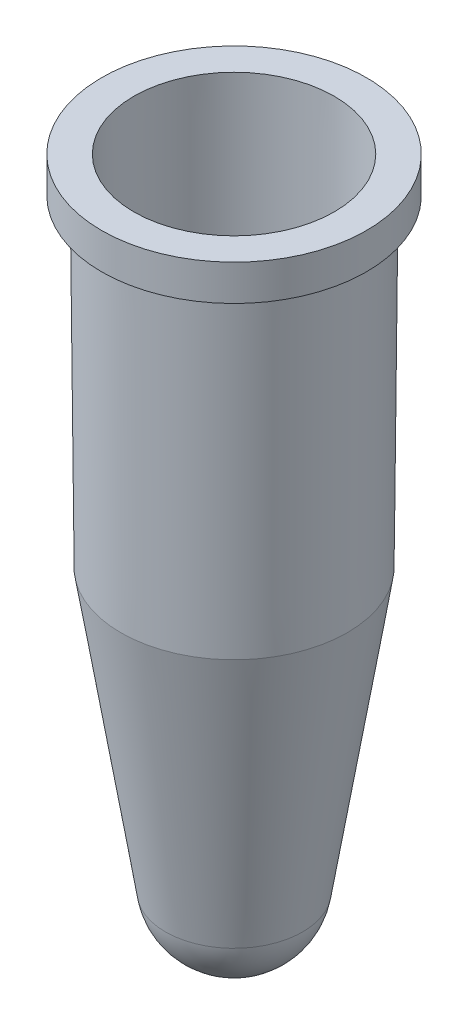
ISO-10303-21;
HEADER;
FILE_DESCRIPTION(('STEP AP214'),'2;1');
FILE_NAME('part.step','',(''),(''),'','','');
FILE_SCHEMA(('AUTOMOTIVE_DESIGN { 1 0 10303 214 1 1 1 1 }'));
ENDSEC;
DATA;
#1=APPLICATION_CONTEXT('core data for automotive mechanical design processes');
#2=APPLICATION_PROTOCOL_DEFINITION('international standard','automotive_design',2000,#1);
#3=PRODUCT_CONTEXT('',#1,'mechanical');
#4=PRODUCT('Part','Part','',(#3));
#5=PRODUCT_RELATED_PRODUCT_CATEGORY('part','',(#4));
#6=PRODUCT_DEFINITION_FORMATION('','',#4);
#7=PRODUCT_DEFINITION_CONTEXT('part definition',#1,'design');
#8=PRODUCT_DEFINITION('design','',#6,#7);
#9=PRODUCT_DEFINITION_SHAPE('','',#8);
#10=(LENGTH_UNIT() NAMED_UNIT(*) SI_UNIT(.MILLI.,.METRE.));
#11=(NAMED_UNIT(*) PLANE_ANGLE_UNIT() SI_UNIT($,.RADIAN.));
#12=(NAMED_UNIT(*) SI_UNIT($,.STERADIAN.) SOLID_ANGLE_UNIT());
#13=UNCERTAINTY_MEASURE_WITH_UNIT(LENGTH_MEASURE(1.E-05),#10,'distance_accuracy_value','');
#14=(GEOMETRIC_REPRESENTATION_CONTEXT(3) GLOBAL_UNCERTAINTY_ASSIGNED_CONTEXT((#13)) GLOBAL_UNIT_ASSIGNED_CONTEXT((#10,
#11,#12)) REPRESENTATION_CONTEXT('',''));
#15=CARTESIAN_POINT('',(0.,0.,0.));
#16=DIRECTION('',(0.,0.,1.));
#17=DIRECTION('',(1.,0.,0.));
#18=AXIS2_PLACEMENT_3D('',#15,#16,#17);
#19=CARTESIAN_POINT('',(0.,-32.4602885822284,0.));
#20=DIRECTION('',(0.,1.,0.));
#21=DIRECTION('',(-1.,0.,0.));
#22=AXIS2_PLACEMENT_3D('',#19,#20,#21);
#23=SPHERICAL_SURFACE('',#22,2.55833788790338);
#24=CARTESIAN_POINT('',(0.,-32.8605008011148,0.));
#25=DIRECTION('',(0.,1.,0.));
#26=DIRECTION('',(0.,0.,1.));
#27=AXIS2_PLACEMENT_3D('',#24,#25,#26);
#28=CIRCLE('',#27,2.52684050318496);
#29=CARTESIAN_POINT('',(0.,-32.8605008011148,2.52684050318496));
#30=VERTEX_POINT('',#29);
#31=EDGE_CURVE('E10',#30,#30,#28,.T.);
#32=ORIENTED_EDGE('',*,*,#31,.T.);
#33=EDGE_LOOP('',(#32));
#34=FACE_BOUND('',#33,.T.);
#35=ADVANCED_FACE('F41',(#34),#23,.F.);
#36=CARTESIAN_POINT('',(0.,-19.4300215816871,0.));
#37=DIRECTION('',(0.,1.,0.));
#38=DIRECTION('',(0.,0.,1.));
#39=AXIS2_PLACEMENT_3D('',#36,#37,#38);
#40=CONICAL_SURFACE('',#39,4.65401943764432,0.15707963267949);
#41=ORIENTED_EDGE('',*,*,#31,.F.);
#42=EDGE_LOOP('',(#41));
#43=FACE_BOUND('',#42,.T.);
#44=CARTESIAN_POINT('',(0.,-19.4300215816871,0.));
#45=DIRECTION('',(0.,1.,0.));
#46=DIRECTION('',(0.,0.,1.));
#47=AXIS2_PLACEMENT_3D('',#44,#45,#46);
#48=CIRCLE('',#47,4.65401943764432);
#49=CARTESIAN_POINT('',(0.,-19.4300215816871,4.65401943764432));
#50=VERTEX_POINT('',#49);
#51=EDGE_CURVE('E48',#50,#50,#48,.T.);
#52=ORIENTED_EDGE('',*,*,#51,.T.);
#53=EDGE_LOOP('',(#52));
#54=FACE_BOUND('',#53,.T.);
#55=ADVANCED_FACE('F93',(#43,#54),#40,.F.);
#56=CARTESIAN_POINT('',(0.,-2.33997034364961,0.));
#57=DIRECTION('',(0.,1.,0.));
#58=DIRECTION('',(0.,0.,1.));
#59=AXIS2_PLACEMENT_3D('',#56,#57,#58);
#60=CONICAL_SURFACE('',#59,4.80316205533597,0.00872664625997166);
#61=ORIENTED_EDGE('',*,*,#51,.F.);
#62=EDGE_LOOP('',(#61));
#63=FACE_BOUND('',#62,.T.);
#64=CARTESIAN_POINT('',(0.,-2.33997034364961,0.));
#65=DIRECTION('',(0.,1.,0.));
#66=DIRECTION('',(0.,0.,1.));
#67=AXIS2_PLACEMENT_3D('',#64,#65,#66);
#68=CIRCLE('',#67,4.80316205533597);
#69=CARTESIAN_POINT('',(0.,-2.33997034364961,4.80316205533597));
#70=VERTEX_POINT('',#69);
#71=EDGE_CURVE('E53',#70,#70,#68,.T.);
#72=ORIENTED_EDGE('',*,*,#71,.T.);
#73=EDGE_LOOP('',(#72));
#74=FACE_BOUND('',#73,.T.);
#75=ADVANCED_FACE('F97',(#63,#74),#60,.F.);
#76=CARTESIAN_POINT('',(0.,-2.33997034364961,0.));
#77=DIRECTION('',(0.,1.,0.));
#78=DIRECTION('',(0.,0.,1.));
#79=AXIS2_PLACEMENT_3D('',#76,#77,#78);
#80=PLANE('',#79);
#81=CARTESIAN_POINT('',(0.,-2.33997034364961,0.));
#82=DIRECTION('',(0.,1.,0.));
#83=DIRECTION('',(0.,0.,1.));
#84=AXIS2_PLACEMENT_3D('',#81,#82,#83);
#85=CIRCLE('',#84,6.34703557312253);
#86=CARTESIAN_POINT('',(0.,-2.33997034364961,6.34703557312253));
#87=VERTEX_POINT('',#86);
#88=EDGE_CURVE('E58',#87,#87,#85,.T.);
#89=ORIENTED_EDGE('',*,*,#88,.T.);
#90=EDGE_LOOP('',(#89));
#91=FACE_BOUND('',#90,.T.);
#92=ORIENTED_EDGE('',*,*,#71,.F.);
#93=EDGE_LOOP('',(#92));
#94=FACE_BOUND('',#93,.T.);
#95=ADVANCED_FACE('F102',(#91,#94),#80,.T.);
#96=CARTESIAN_POINT('',(0.,-2.33997034364961,0.));
#97=DIRECTION('',(0.,1.,0.));
#98=DIRECTION('',(0.,0.,1.));
#99=AXIS2_PLACEMENT_3D('',#96,#97,#98);
#100=CYLINDRICAL_SURFACE('',#99,6.34703557312253);
#101=CARTESIAN_POINT('',(0.,-4.05538536341245,0.));
#102=DIRECTION('',(0.,1.,0.));
#103=DIRECTION('',(0.,0.,1.));
#104=AXIS2_PLACEMENT_3D('',#101,#102,#103);
#105=CIRCLE('',#104,6.34703557312253);
#106=CARTESIAN_POINT('',(0.,-4.05538536341245,6.34703557312253));
#107=VERTEX_POINT('',#106);
#108=EDGE_CURVE('E64',#107,#107,#105,.T.);
#109=ORIENTED_EDGE('',*,*,#108,.T.);
#110=EDGE_LOOP('',(#109));
#111=FACE_BOUND('',#110,.T.);
#112=ORIENTED_EDGE('',*,*,#88,.F.);
#113=EDGE_LOOP('',(#112));
#114=FACE_BOUND('',#113,.T.);
#115=ADVANCED_FACE('F108',(#111,#114),#100,.T.);
#116=CARTESIAN_POINT('',(0.,-4.05538536341245,0.));
#117=DIRECTION('',(0.,-1.,0.));
#118=DIRECTION('',(0.,0.,-1.));
#119=AXIS2_PLACEMENT_3D('',#116,#117,#118);
#120=PLANE('',#119);
#121=CARTESIAN_POINT('',(0.,-4.05538536341245,0.));
#122=DIRECTION('',(0.,1.,0.));
#123=DIRECTION('',(0.,0.,1.));
#124=AXIS2_PLACEMENT_3D('',#121,#122,#123);
#125=CIRCLE('',#124,5.56015800825117);
#126=CARTESIAN_POINT('',(0.,-4.05538536341245,5.56015800825117));
#127=VERTEX_POINT('',#126);
#128=EDGE_CURVE('E68',#127,#127,#125,.T.);
#129=ORIENTED_EDGE('',*,*,#128,.T.);
#130=EDGE_LOOP('',(#129));
#131=FACE_BOUND('',#130,.T.);
#132=ORIENTED_EDGE('',*,*,#108,.F.);
#133=EDGE_LOOP('',(#132));
#134=FACE_BOUND('',#133,.T.);
#135=ADVANCED_FACE('F112',(#131,#134),#120,.T.);
#136=CARTESIAN_POINT('',(0.,-4.05538536341245,0.));
#137=DIRECTION('',(0.,1.,0.));
#138=DIRECTION('',(0.,0.,1.));
#139=AXIS2_PLACEMENT_3D('',#136,#137,#138);
#140=CONICAL_SURFACE('',#139,5.56015800825117,0.00872664625997171);
#141=CARTESIAN_POINT('',(0.,-19.4941205412781,0.));
#142=DIRECTION('',(0.,1.,0.));
#143=DIRECTION('',(0.,0.,1.));
#144=AXIS2_PLACEMENT_3D('',#141,#142,#143);
#145=CIRCLE('',#144,5.4254262074974);
#146=CARTESIAN_POINT('',(0.,-19.4941205412781,5.4254262074974));
#147=VERTEX_POINT('',#146);
#148=EDGE_CURVE('E72',#147,#147,#145,.T.);
#149=ORIENTED_EDGE('',*,*,#148,.T.);
#150=EDGE_LOOP('',(#149));
#151=FACE_BOUND('',#150,.T.);
#152=ORIENTED_EDGE('',*,*,#128,.F.);
#153=EDGE_LOOP('',(#152));
#154=FACE_BOUND('',#153,.T.);
#155=ADVANCED_FACE('F90',(#151,#154),#140,.T.);
#156=CARTESIAN_POINT('',(0.,-19.4941205412781,0.));
#157=DIRECTION('',(0.,1.,0.));
#158=DIRECTION('',(0.,0.,1.));
#159=AXIS2_PLACEMENT_3D('',#156,#157,#158);
#160=CONICAL_SURFACE('',#159,5.4254262074974,0.15707963267949);
#161=CARTESIAN_POINT('',(0.,-32.9812583150371,0.));
#162=DIRECTION('',(0.,1.,0.));
#163=DIRECTION('',(0.,0.,1.));
#164=AXIS2_PLACEMENT_3D('',#161,#162,#163);
#165=CIRCLE('',#164,3.28927343962065);
#166=CARTESIAN_POINT('',(0.,-32.9812583150371,3.28927343962065));
#167=VERTEX_POINT('',#166);
#168=EDGE_CURVE('E76',#167,#167,#165,.T.);
#169=ORIENTED_EDGE('',*,*,#168,.T.);
#170=EDGE_LOOP('',(#169));
#171=FACE_BOUND('',#170,.T.);
#172=ORIENTED_EDGE('',*,*,#148,.F.);
#173=EDGE_LOOP('',(#172));
#174=FACE_BOUND('',#173,.T.);
#175=ADVANCED_FACE('F81',(#171,#174),#160,.T.);
#176=CARTESIAN_POINT('',(0.,-32.4602885822284,0.));
#177=DIRECTION('',(0.,1.,0.));
#178=DIRECTION('',(-1.,0.,0.));
#179=AXIS2_PLACEMENT_3D('',#176,#177,#178);
#180=SPHERICAL_SURFACE('',#179,3.33027464679666);
#181=ORIENTED_EDGE('',*,*,#168,.F.);
#182=EDGE_LOOP('',(#181));
#183=FACE_BOUND('',#182,.T.);
#184=ADVANCED_FACE('F84',(#183),#180,.T.);
#185=CLOSED_SHELL('',(#35,#55,#75,#95,#115,#135,#155,#175,#184));
#186=MANIFOLD_SOLID_BREP('B2',#185);
#187=ADVANCED_BREP_SHAPE_REPRESENTATION('',(#18,#186),#14);
#188=SHAPE_DEFINITION_REPRESENTATION(#9,#187);
ENDSEC;
END-ISO-10303-21;
